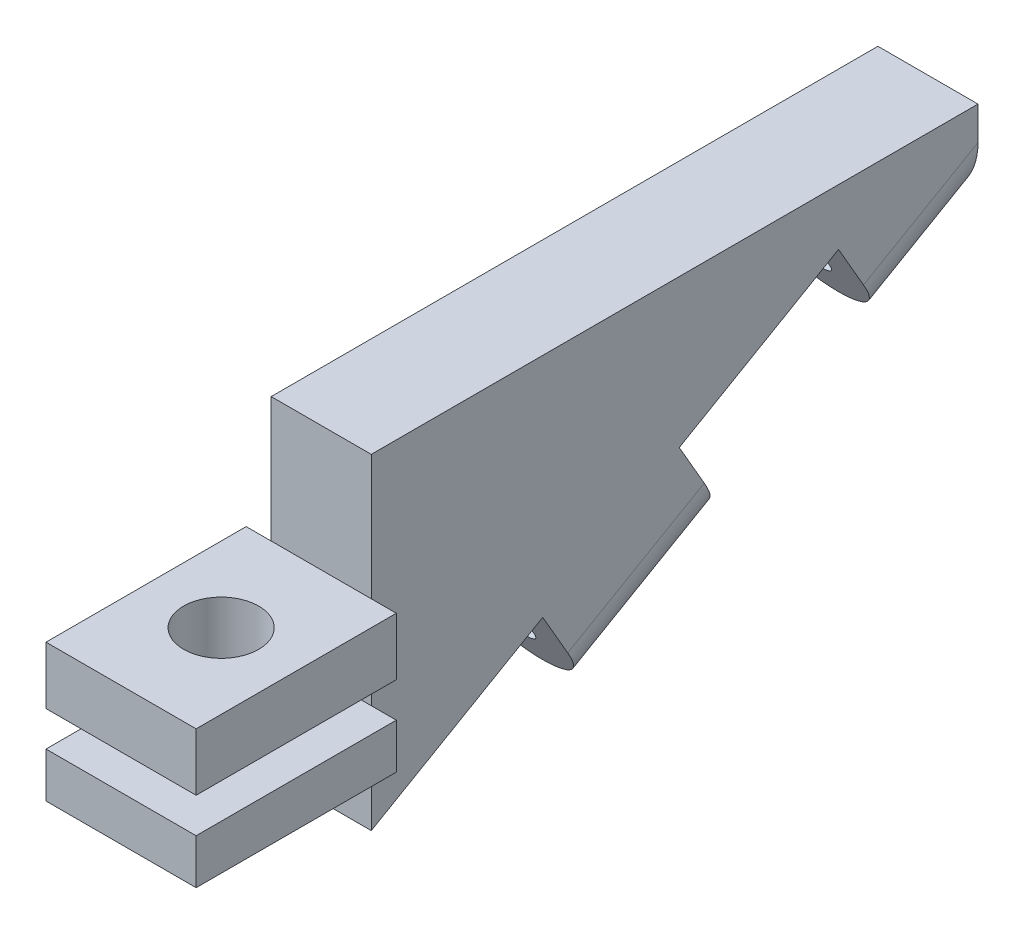
ISO-10303-21;
HEADER;
FILE_DESCRIPTION(('STEP AP214'),'2;1');
FILE_NAME('part.step','',(''),(''),'','','');
FILE_SCHEMA(('AUTOMOTIVE_DESIGN { 1 0 10303 214 1 1 1 1 }'));
ENDSEC;
DATA;
#1=APPLICATION_CONTEXT('core data for automotive mechanical design processes');
#2=APPLICATION_PROTOCOL_DEFINITION('international standard','automotive_design',2000,#1);
#3=PRODUCT_CONTEXT('',#1,'mechanical');
#4=PRODUCT('Part','Part','',(#3));
#5=PRODUCT_RELATED_PRODUCT_CATEGORY('part','',(#4));
#6=PRODUCT_DEFINITION_FORMATION('','',#4);
#7=PRODUCT_DEFINITION_CONTEXT('part definition',#1,'design');
#8=PRODUCT_DEFINITION('design','',#6,#7);
#9=PRODUCT_DEFINITION_SHAPE('','',#8);
#10=(LENGTH_UNIT() NAMED_UNIT(*) SI_UNIT(.MILLI.,.METRE.));
#11=(NAMED_UNIT(*) PLANE_ANGLE_UNIT() SI_UNIT($,.RADIAN.));
#12=(NAMED_UNIT(*) SI_UNIT($,.STERADIAN.) SOLID_ANGLE_UNIT());
#13=UNCERTAINTY_MEASURE_WITH_UNIT(LENGTH_MEASURE(1.E-05),#10,'distance_accuracy_value','');
#14=(GEOMETRIC_REPRESENTATION_CONTEXT(3) GLOBAL_UNCERTAINTY_ASSIGNED_CONTEXT((#13)) GLOBAL_UNIT_ASSIGNED_CONTEXT((#10,
#11,#12)) REPRESENTATION_CONTEXT('',''));
#15=CARTESIAN_POINT('',(0.,0.,0.));
#16=DIRECTION('',(0.,0.,1.));
#17=DIRECTION('',(1.,0.,0.));
#18=AXIS2_PLACEMENT_3D('',#15,#16,#17);
#19=CARTESIAN_POINT('',(3.,-1.,35.2487113059643));
#20=DIRECTION('',(0.,0.,-1.));
#21=DIRECTION('',(-1.,0.,0.));
#22=AXIS2_PLACEMENT_3D('',#19,#20,#21);
#23=PLANE('',#22);
#24=DIRECTION('',(0.,1.,0.));
#25=VECTOR('',#24,1.);
#26=CARTESIAN_POINT('',(-3.,-1.,35.2487113059643));
#27=LINE('',#26,#25);
#28=CARTESIAN_POINT('',(-3.,-1.,35.2487113059643));
#29=VERTEX_POINT('',#28);
#30=CARTESIAN_POINT('',(-3.,0.8,35.2487113059643));
#31=VERTEX_POINT('',#30);
#32=EDGE_CURVE('E312',#29,#31,#27,.T.);
#33=ORIENTED_EDGE('',*,*,#32,.T.);
#34=DIRECTION('',(-1.,0.,0.));
#35=VECTOR('',#34,1.);
#36=CARTESIAN_POINT('',(-3.,0.8,35.2487113059643));
#37=LINE('',#36,#35);
#38=CARTESIAN_POINT('',(-2.,0.8,35.2487113059643));
#39=VERTEX_POINT('',#38);
#40=EDGE_CURVE('E251',#39,#31,#37,.T.);
#41=ORIENTED_EDGE('',*,*,#40,.F.);
#42=DIRECTION('',(0.,1.,0.));
#43=VECTOR('',#42,1.);
#44=CARTESIAN_POINT('',(-2.,9.5,35.2487113059643));
#45=LINE('',#44,#43);
#46=CARTESIAN_POINT('',(-2.,-0.999999999999999,35.2487113059643));
#47=VERTEX_POINT('',#46);
#48=EDGE_CURVE('E339',#47,#39,#45,.T.);
#49=ORIENTED_EDGE('',*,*,#48,.F.);
#50=DIRECTION('',(-1.,0.,0.));
#51=VECTOR('',#50,1.);
#52=CARTESIAN_POINT('',(3.,-1.,35.2487113059643));
#53=LINE('',#52,#51);
#54=EDGE_CURVE('E306',#47,#29,#53,.T.);
#55=ORIENTED_EDGE('',*,*,#54,.T.);
#56=EDGE_LOOP('',(#33,#41,#49,#55));
#57=FACE_BOUND('',#56,.T.);
#58=ADVANCED_FACE('F35',(#57),#23,.T.);
#59=DIRECTION('',(0.,-1.,0.));
#60=VECTOR('',#59,1.);
#61=CARTESIAN_POINT('',(2.,9.5,35.2487113059643));
#62=LINE('',#61,#60);
#63=CARTESIAN_POINT('',(2.,0.8,35.2487113059643));
#64=VERTEX_POINT('',#63);
#65=CARTESIAN_POINT('',(2.,-1.,35.2487113059643));
#66=VERTEX_POINT('',#65);
#67=EDGE_CURVE('E347',#64,#66,#62,.T.);
#68=ORIENTED_EDGE('',*,*,#67,.F.);
#69=CARTESIAN_POINT('',(3.,0.8,35.2487113059643));
#70=VERTEX_POINT('',#69);
#71=EDGE_CURVE('E252',#70,#64,#37,.T.);
#72=ORIENTED_EDGE('',*,*,#71,.F.);
#73=DIRECTION('',(0.,1.,0.));
#74=VECTOR('',#73,1.);
#75=CARTESIAN_POINT('',(3.,-1.,35.2487113059643));
#76=LINE('',#75,#74);
#77=CARTESIAN_POINT('',(3.,-1.,35.2487113059643));
#78=VERTEX_POINT('',#77);
#79=EDGE_CURVE('E317',#78,#70,#76,.T.);
#80=ORIENTED_EDGE('',*,*,#79,.F.);
#81=EDGE_CURVE('E307',#78,#66,#53,.T.);
#82=ORIENTED_EDGE('',*,*,#81,.T.);
#83=EDGE_LOOP('',(#68,#72,#80,#82));
#84=FACE_BOUND('',#83,.T.);
#85=ADVANCED_FACE('F444',(#84),#23,.T.);
#86=CARTESIAN_POINT('',(-3.,-1.,43.2487113059643));
#87=DIRECTION('',(-1.,0.,0.));
#88=DIRECTION('',(0.,0.,1.));
#89=AXIS2_PLACEMENT_3D('',#86,#87,#88);
#90=PLANE('',#89);
#91=DIRECTION('',(0.,1.,0.));
#92=VECTOR('',#91,1.);
#93=CARTESIAN_POINT('',(-3.,-1.,43.2487113059643));
#94=LINE('',#93,#92);
#95=CARTESIAN_POINT('',(-3.,-1.,43.2487113059643));
#96=VERTEX_POINT('',#95);
#97=CARTESIAN_POINT('',(-3.,0.8,43.2487113059643));
#98=VERTEX_POINT('',#97);
#99=EDGE_CURVE('E325',#96,#98,#94,.T.);
#100=ORIENTED_EDGE('',*,*,#99,.T.);
#101=DIRECTION('',(0.,0.,1.));
#102=VECTOR('',#101,1.);
#103=CARTESIAN_POINT('',(-3.,0.8,35.2487113059643));
#104=LINE('',#103,#102);
#105=EDGE_CURVE('E219',#31,#98,#104,.T.);
#106=ORIENTED_EDGE('',*,*,#105,.F.);
#107=ORIENTED_EDGE('',*,*,#32,.F.);
#108=DIRECTION('',(0.,0.,1.));
#109=VECTOR('',#108,1.);
#110=CARTESIAN_POINT('',(-3.,-1.,43.2487113059643));
#111=LINE('',#110,#109);
#112=EDGE_CURVE('E296',#29,#96,#111,.T.);
#113=ORIENTED_EDGE('',*,*,#112,.T.);
#114=EDGE_LOOP('',(#100,#106,#107,#113));
#115=FACE_BOUND('',#114,.T.);
#116=ADVANCED_FACE('F428',(#115),#90,.T.);
#117=CARTESIAN_POINT('',(3.,-1.,43.2487113059643));
#118=DIRECTION('',(1.,0.,0.));
#119=DIRECTION('',(0.,0.,-1.));
#120=AXIS2_PLACEMENT_3D('',#117,#118,#119);
#121=PLANE('',#120);
#122=ORIENTED_EDGE('',*,*,#79,.T.);
#123=DIRECTION('',(0.,0.,-1.));
#124=VECTOR('',#123,1.);
#125=CARTESIAN_POINT('',(3.,0.8,43.2487113059643));
#126=LINE('',#125,#124);
#127=CARTESIAN_POINT('',(3.,0.8,43.2487113059643));
#128=VERTEX_POINT('',#127);
#129=EDGE_CURVE('E249',#128,#70,#126,.T.);
#130=ORIENTED_EDGE('',*,*,#129,.F.);
#131=DIRECTION('',(0.,1.,0.));
#132=VECTOR('',#131,1.);
#133=CARTESIAN_POINT('',(3.,-1.,43.2487113059643));
#134=LINE('',#133,#132);
#135=CARTESIAN_POINT('',(3.,-1.,43.2487113059643));
#136=VERTEX_POINT('',#135);
#137=EDGE_CURVE('E321',#136,#128,#134,.T.);
#138=ORIENTED_EDGE('',*,*,#137,.F.);
#139=DIRECTION('',(0.,0.,-1.));
#140=VECTOR('',#139,1.);
#141=CARTESIAN_POINT('',(3.,-1.,43.2487113059643));
#142=LINE('',#141,#140);
#143=EDGE_CURVE('E303',#136,#78,#142,.T.);
#144=ORIENTED_EDGE('',*,*,#143,.T.);
#145=EDGE_LOOP('',(#122,#130,#138,#144));
#146=FACE_BOUND('',#145,.T.);
#147=ADVANCED_FACE('F441',(#146),#121,.T.);
#148=CARTESIAN_POINT('',(3.,-1.,43.2487113059643));
#149=DIRECTION('',(0.,0.,1.));
#150=DIRECTION('',(1.,0.,0.));
#151=AXIS2_PLACEMENT_3D('',#148,#149,#150);
#152=PLANE('',#151);
#153=ORIENTED_EDGE('',*,*,#137,.T.);
#154=DIRECTION('',(1.,0.,0.));
#155=VECTOR('',#154,1.);
#156=CARTESIAN_POINT('',(-3.,0.8,43.2487113059643));
#157=LINE('',#156,#155);
#158=EDGE_CURVE('E247',#98,#128,#157,.T.);
#159=ORIENTED_EDGE('',*,*,#158,.F.);
#160=ORIENTED_EDGE('',*,*,#99,.F.);
#161=DIRECTION('',(1.,0.,0.));
#162=VECTOR('',#161,1.);
#163=CARTESIAN_POINT('',(3.,-1.,43.2487113059643));
#164=LINE('',#163,#162);
#165=EDGE_CURVE('E300',#96,#136,#164,.T.);
#166=ORIENTED_EDGE('',*,*,#165,.T.);
#167=EDGE_LOOP('',(#153,#159,#160,#166));
#168=FACE_BOUND('',#167,.T.);
#169=ADVANCED_FACE('F433',(#168),#152,.T.);
#170=CARTESIAN_POINT('',(0.,-6.5,39.2487113059643));
#171=DIRECTION('',(0.,1.,0.));
#172=DIRECTION('',(0.,0.,1.));
#173=AXIS2_PLACEMENT_3D('',#170,#171,#172);
#174=CYLINDRICAL_SURFACE('',#173,1.5);
#175=CARTESIAN_POINT('',(0.,-1.,39.2487113059643));
#176=DIRECTION('',(0.,1.,0.));
#177=DIRECTION('',(0.,0.,1.));
#178=AXIS2_PLACEMENT_3D('',#175,#176,#177);
#179=CIRCLE('',#178,1.5);
#180=CARTESIAN_POINT('',(0.,-1.,40.7487113059643));
#181=VERTEX_POINT('',#180);
#182=EDGE_CURVE('E280',#181,#181,#179,.T.);
#183=ORIENTED_EDGE('',*,*,#182,.F.);
#184=EDGE_LOOP('',(#183));
#185=FACE_BOUND('',#184,.T.);
#186=CARTESIAN_POINT('',(0.,0.8,39.2487113059643));
#187=DIRECTION('',(0.,1.,0.));
#188=DIRECTION('',(0.,0.,1.));
#189=AXIS2_PLACEMENT_3D('',#186,#187,#188);
#190=CIRCLE('',#189,1.5);
#191=CARTESIAN_POINT('',(0.,0.8,40.7487113059643));
#192=VERTEX_POINT('',#191);
#193=EDGE_CURVE('E269',#192,#192,#190,.F.);
#194=ORIENTED_EDGE('',*,*,#193,.F.);
#195=EDGE_LOOP('',(#194));
#196=FACE_BOUND('',#195,.T.);
#197=ADVANCED_FACE('F512',(#185,#196),#174,.F.);
#198=CARTESIAN_POINT('',(31.0516780926679,9.5,35.2487113059643));
#199=DIRECTION('',(0.,0.,-1.));
#200=DIRECTION('',(-1.,0.,0.));
#201=AXIS2_PLACEMENT_3D('',#198,#199,#200);
#202=PLANE('',#201);
#203=DIRECTION('',(-1.,0.,0.));
#204=VECTOR('',#203,1.);
#205=CARTESIAN_POINT('',(3.,4.5,35.2487113059643));
#206=LINE('',#205,#204);
#207=CARTESIAN_POINT('',(2.,4.5,35.2487113059643));
#208=VERTEX_POINT('',#207);
#209=CARTESIAN_POINT('',(-2.,4.5,35.2487113059643));
#210=VERTEX_POINT('',#209);
#211=EDGE_CURVE('E297',#208,#210,#206,.T.);
#212=ORIENTED_EDGE('',*,*,#211,.F.);
#213=CARTESIAN_POINT('',(2.,9.5,35.2487113059643));
#214=VERTEX_POINT('',#213);
#215=EDGE_CURVE('E343',#214,#208,#62,.T.);
#216=ORIENTED_EDGE('',*,*,#215,.F.);
#217=DIRECTION('',(-1.,0.,0.));
#218=VECTOR('',#217,1.);
#219=CARTESIAN_POINT('',(31.0516780926679,9.5,35.2487113059643));
#220=LINE('',#219,#218);
#221=CARTESIAN_POINT('',(-2.,9.5,35.2487113059643));
#222=VERTEX_POINT('',#221);
#223=EDGE_CURVE('E338',#214,#222,#220,.T.);
#224=ORIENTED_EDGE('',*,*,#223,.T.);
#225=EDGE_CURVE('E335',#210,#222,#45,.T.);
#226=ORIENTED_EDGE('',*,*,#225,.F.);
#227=EDGE_LOOP('',(#212,#216,#224,#226));
#228=FACE_BOUND('',#227,.T.);
#229=ADVANCED_FACE('F456',(#228),#202,.F.);
#230=CARTESIAN_POINT('',(-2.,0.,0.));
#231=DIRECTION('',(1.,0.,0.));
#232=DIRECTION('',(0.,0.,-1.));
#233=AXIS2_PLACEMENT_3D('',#230,#231,#232);
#234=PLANE('',#233);
#235=DIRECTION('',(0.,-1.,0.));
#236=VECTOR('',#235,1.);
#237=CARTESIAN_POINT('',(-2.,9.5,11.));
#238=LINE('',#237,#236);
#239=CARTESIAN_POINT('',(-2.,9.5,11.));
#240=VERTEX_POINT('',#239);
#241=CARTESIAN_POINT('',(-2.,8.16666666666687,11.));
#242=VERTEX_POINT('',#241);
#243=EDGE_CURVE('E330',#240,#242,#238,.T.);
#244=ORIENTED_EDGE('',*,*,#243,.T.);
#245=DIRECTION('',(0.,-0.500000000000007,0.866025403784435));
#246=VECTOR('',#245,1.);
#247=CARTESIAN_POINT('',(-2.,10.8881397208146,6.28627039878665));
#248=LINE('',#247,#246);
#249=CARTESIAN_POINT('',(-2.,5.52500000000014,15.5755008833278));
#250=VERTEX_POINT('',#249);
#251=EDGE_CURVE('E205',#242,#250,#248,.T.);
#252=ORIENTED_EDGE('',*,*,#251,.T.);
#253=DIRECTION('',(0.,0.866025403784438,0.500000000000001));
#254=VECTOR('',#253,1.);
#255=CARTESIAN_POINT('',(-2.,-5.36313972081439,9.28923048454127));
#256=LINE('',#255,#254);
#257=CARTESIAN_POINT('',(-2.,7.25705080756901,16.5755008833278));
#258=VERTEX_POINT('',#257);
#259=EDGE_CURVE('E198',#250,#258,#256,.T.);
#260=ORIENTED_EDGE('',*,*,#259,.T.);
#261=DIRECTION('',(0.,-0.500000000000007,0.866025403784435));
#262=VECTOR('',#261,1.);
#263=CARTESIAN_POINT('',(-2.,12.6201905283834,7.28627039878666));
#264=LINE('',#263,#262);
#265=CARTESIAN_POINT('',(-2.,3.58205080756896,22.9407876011434));
#266=VERTEX_POINT('',#265);
#267=EDGE_CURVE('E203',#258,#266,#264,.T.);
#268=ORIENTED_EDGE('',*,*,#267,.T.);
#269=DIRECTION('',(0.,-0.866025403784442,-0.499999999999995));
#270=VECTOR('',#269,1.);
#271=CARTESIAN_POINT('',(-2.,-9.03813972081434,15.654517202357));
#272=LINE('',#271,#270);
#273=CARTESIAN_POINT('',(-2.,1.8500000000001,21.9407876011434));
#274=VERTEX_POINT('',#273);
#275=EDGE_CURVE('E235',#266,#274,#272,.T.);
#276=ORIENTED_EDGE('',*,*,#275,.T.);
#277=DIRECTION('',(0.,-0.500000000000006,0.866025403784435));
#278=VECTOR('',#277,1.);
#279=CARTESIAN_POINT('',(-2.,10.8881397208146,6.28627039878665));
#280=LINE('',#279,#278);
#281=CARTESIAN_POINT('',(-2.,-1.29999999999997,27.3967476449854));
#282=VERTEX_POINT('',#281);
#283=EDGE_CURVE('E371',#274,#282,#280,.T.);
#284=ORIENTED_EDGE('',*,*,#283,.T.);
#285=DIRECTION('',(0.,0.866025403784436,0.500000000000005));
#286=VECTOR('',#285,1.);
#287=CARTESIAN_POINT('',(-2.,-12.1881397208145,21.1104772461988));
#288=LINE('',#287,#286);
#289=CARTESIAN_POINT('',(-2.,0.432050807568894,28.3967476449854));
#290=VERTEX_POINT('',#289);
#291=EDGE_CURVE('E240',#282,#290,#288,.T.);
#292=ORIENTED_EDGE('',*,*,#291,.T.);
#293=DIRECTION('',(0.,-0.500000000000006,0.866025403784435));
#294=VECTOR('',#293,1.);
#295=CARTESIAN_POINT('',(-2.,12.6201905283834,7.28627039878665));
#296=LINE('',#295,#294);
#297=CARTESIAN_POINT('',(-2.,-3.52393225657485,35.2487113059643));
#298=VERTEX_POINT('',#297);
#299=EDGE_CURVE('E220',#290,#298,#296,.T.);
#300=ORIENTED_EDGE('',*,*,#299,.T.);
#301=EDGE_CURVE('E336',#298,#47,#45,.T.);
#302=ORIENTED_EDGE('',*,*,#301,.T.);
#303=ORIENTED_EDGE('',*,*,#48,.T.);
#304=DIRECTION('',(0.,-1.,0.));
#305=VECTOR('',#304,1.);
#306=CARTESIAN_POINT('',(-2.,0.,35.2487113059643));
#307=LINE('',#306,#305);
#308=CARTESIAN_POINT('',(-2.,2.2,35.2487113059643));
#309=VERTEX_POINT('',#308);
#310=EDGE_CURVE('E274',#309,#39,#307,.T.);
#311=ORIENTED_EDGE('',*,*,#310,.F.);
#312=EDGE_CURVE('E340',#309,#210,#45,.T.);
#313=ORIENTED_EDGE('',*,*,#312,.T.);
#314=ORIENTED_EDGE('',*,*,#225,.T.);
#315=DIRECTION('',(0.,0.,-1.));
#316=VECTOR('',#315,1.);
#317=CARTESIAN_POINT('',(-2.,9.5,35.2487113059643));
#318=LINE('',#317,#316);
#319=EDGE_CURVE('E332',#222,#240,#318,.T.);
#320=ORIENTED_EDGE('',*,*,#319,.T.);
#321=EDGE_LOOP('',(#244,#252,#260,#268,#276,#284,#292,#300,#302,#303,#311,#313,#314,#320));
#322=FACE_BOUND('',#321,.T.);
#323=ADVANCED_FACE('F201',(#322),#234,.F.);
#324=CARTESIAN_POINT('',(2.,0.,0.));
#325=DIRECTION('',(1.,0.,0.));
#326=DIRECTION('',(0.,0.,-1.));
#327=AXIS2_PLACEMENT_3D('',#324,#325,#326);
#328=PLANE('',#327);
#329=DIRECTION('',(0.,0.866025403784438,0.500000000000001));
#330=VECTOR('',#329,1.);
#331=CARTESIAN_POINT('',(2.,-5.36313972081439,9.28923048454127));
#332=LINE('',#331,#330);
#333=CARTESIAN_POINT('',(2.,5.52500000000014,15.5755008833278));
#334=VERTEX_POINT('',#333);
#335=CARTESIAN_POINT('',(2.,7.25705080756901,16.5755008833278));
#336=VERTEX_POINT('',#335);
#337=EDGE_CURVE('E209',#334,#336,#332,.T.);
#338=ORIENTED_EDGE('',*,*,#337,.F.);
#339=DIRECTION('',(0.,-0.500000000000007,0.866025403784435));
#340=VECTOR('',#339,1.);
#341=CARTESIAN_POINT('',(2.,7.58931639747722,12.));
#342=LINE('',#341,#340);
#343=CARTESIAN_POINT('',(2.,8.16666666666687,11.));
#344=VERTEX_POINT('',#343);
#345=EDGE_CURVE('E385',#334,#344,#342,.F.);
#346=ORIENTED_EDGE('',*,*,#345,.T.);
#347=DIRECTION('',(0.,1.,0.));
#348=VECTOR('',#347,1.);
#349=CARTESIAN_POINT('',(2.,9.5,11.));
#350=LINE('',#349,#348);
#351=CARTESIAN_POINT('',(2.,9.5,11.));
#352=VERTEX_POINT('',#351);
#353=EDGE_CURVE('E341',#344,#352,#350,.T.);
#354=ORIENTED_EDGE('',*,*,#353,.T.);
#355=DIRECTION('',(0.,0.,1.));
#356=VECTOR('',#355,1.);
#357=CARTESIAN_POINT('',(2.,9.5,35.2487113059643));
#358=LINE('',#357,#356);
#359=EDGE_CURVE('E348',#352,#214,#358,.T.);
#360=ORIENTED_EDGE('',*,*,#359,.T.);
#361=ORIENTED_EDGE('',*,*,#215,.T.);
#362=CARTESIAN_POINT('',(2.,2.2,35.2487113059643));
#363=VERTEX_POINT('',#362);
#364=EDGE_CURVE('E346',#208,#363,#62,.T.);
#365=ORIENTED_EDGE('',*,*,#364,.T.);
#366=DIRECTION('',(0.,-1.,0.));
#367=VECTOR('',#366,1.);
#368=CARTESIAN_POINT('',(2.,0.,35.2487113059643));
#369=LINE('',#368,#367);
#370=EDGE_CURVE('E271',#363,#64,#369,.T.);
#371=ORIENTED_EDGE('',*,*,#370,.T.);
#372=ORIENTED_EDGE('',*,*,#67,.T.);
#373=CARTESIAN_POINT('',(2.,-3.52393225657485,35.2487113059643));
#374=VERTEX_POINT('',#373);
#375=EDGE_CURVE('E351',#66,#374,#62,.T.);
#376=ORIENTED_EDGE('',*,*,#375,.T.);
#377=DIRECTION('',(0.,-0.500000000000006,0.866025403784435));
#378=VECTOR('',#377,1.);
#379=CARTESIAN_POINT('',(2.,12.6201905283834,7.28627039878665));
#380=LINE('',#379,#378);
#381=CARTESIAN_POINT('',(2.,0.432050807568894,28.3967476449854));
#382=VERTEX_POINT('',#381);
#383=EDGE_CURVE('E242',#382,#374,#380,.T.);
#384=ORIENTED_EDGE('',*,*,#383,.F.);
#385=DIRECTION('',(0.,0.866025403784436,0.500000000000005));
#386=VECTOR('',#385,1.);
#387=CARTESIAN_POINT('',(2.,-12.1881397208145,21.1104772461988));
#388=LINE('',#387,#386);
#389=CARTESIAN_POINT('',(2.,-1.29999999999997,27.3967476449854));
#390=VERTEX_POINT('',#389);
#391=EDGE_CURVE('E238',#390,#382,#388,.T.);
#392=ORIENTED_EDGE('',*,*,#391,.F.);
#393=DIRECTION('',(0.,-0.500000000000006,0.866025403784435));
#394=VECTOR('',#393,1.);
#395=CARTESIAN_POINT('',(2.,1.85000000000008,21.9407876011435));
#396=LINE('',#395,#394);
#397=CARTESIAN_POINT('',(2.,1.8500000000001,21.9407876011434));
#398=VERTEX_POINT('',#397);
#399=EDGE_CURVE('E383',#390,#398,#396,.F.);
#400=ORIENTED_EDGE('',*,*,#399,.T.);
#401=DIRECTION('',(0.,-0.866025403784442,-0.499999999999995));
#402=VECTOR('',#401,1.);
#403=CARTESIAN_POINT('',(2.,-9.03813972081434,15.654517202357));
#404=LINE('',#403,#402);
#405=CARTESIAN_POINT('',(2.,3.58205080756896,22.9407876011434));
#406=VERTEX_POINT('',#405);
#407=EDGE_CURVE('E233',#406,#398,#404,.T.);
#408=ORIENTED_EDGE('',*,*,#407,.F.);
#409=DIRECTION('',(0.,-0.500000000000007,0.866025403784435));
#410=VECTOR('',#409,1.);
#411=CARTESIAN_POINT('',(2.,12.6201905283834,7.28627039878666));
#412=LINE('',#411,#410);
#413=EDGE_CURVE('E369',#336,#406,#412,.T.);
#414=ORIENTED_EDGE('',*,*,#413,.F.);
#415=EDGE_LOOP('',(#338,#346,#354,#360,#361,#365,#371,#372,#376,#384,#392,#400,#408,#414));
#416=FACE_BOUND('',#415,.T.);
#417=ADVANCED_FACE('F399',(#416),#328,.T.);
#418=ORIENTED_EDGE('',*,*,#301,.F.);
#419=DIRECTION('',(1.,0.,0.));
#420=VECTOR('',#419,1.);
#421=CARTESIAN_POINT('',(31.0516780926679,-3.52393225657485,35.2487113059643));
#422=LINE('',#421,#420);
#423=EDGE_CURVE('E366',#298,#374,#422,.T.);
#424=ORIENTED_EDGE('',*,*,#423,.T.);
#425=ORIENTED_EDGE('',*,*,#375,.F.);
#426=EDGE_CURVE('E311',#66,#47,#53,.T.);
#427=ORIENTED_EDGE('',*,*,#426,.T.);
#428=EDGE_LOOP('',(#418,#424,#425,#427));
#429=FACE_BOUND('',#428,.T.);
#430=ADVANCED_FACE('F415',(#429),#202,.F.);
#431=CARTESIAN_POINT('',(31.0516780926679,9.5,11.));
#432=DIRECTION('',(0.,0.,1.));
#433=DIRECTION('',(1.,0.,0.));
#434=AXIS2_PLACEMENT_3D('',#431,#432,#433);
#435=PLANE('',#434);
#436=CARTESIAN_POINT('',(0.,8.16666666666669,11.));
#437=DIRECTION('',(0.,0.,1.));
#438=DIRECTION('',(0.,-1.,0.));
#439=AXIS2_PLACEMENT_3D('',#436,#437,#438);
#440=ELLIPSE('',#439,0.750555349946512,0.649999999999999);
#441=CARTESIAN_POINT('',(0.,7.41611131672018,11.));
#442=VERTEX_POINT('',#441);
#443=EDGE_CURVE('E315',#442,#442,#440,.T.);
#444=ORIENTED_EDGE('',*,*,#443,.T.);
#445=EDGE_LOOP('',(#444));
#446=FACE_BOUND('',#445,.T.);
#447=CARTESIAN_POINT('',(0.,8.16666666666687,11.));
#448=DIRECTION('',(0.,0.,1.));
#449=DIRECTION('',(0.,1.,0.));
#450=AXIS2_PLACEMENT_3D('',#447,#448,#449);
#451=ELLIPSE('',#450,2.30940107675851,2.);
#452=CARTESIAN_POINT('',(0.,5.85726558990835,11.));
#453=VERTEX_POINT('',#452);
#454=EDGE_CURVE('E379',#344,#453,#451,.F.);
#455=ORIENTED_EDGE('',*,*,#454,.T.);
#456=CARTESIAN_POINT('',(0.,8.16666666666687,11.));
#457=DIRECTION('',(0.,0.,1.));
#458=DIRECTION('',(0.,-1.,0.));
#459=AXIS2_PLACEMENT_3D('',#456,#457,#458);
#460=ELLIPSE('',#459,2.30940107675851,2.);
#461=EDGE_CURVE('E381',#453,#242,#460,.F.);
#462=ORIENTED_EDGE('',*,*,#461,.T.);
#463=ORIENTED_EDGE('',*,*,#243,.F.);
#464=DIRECTION('',(-1.,0.,0.));
#465=VECTOR('',#464,1.);
#466=CARTESIAN_POINT('',(31.0516780926679,9.5,11.));
#467=LINE('',#466,#465);
#468=EDGE_CURVE('E352',#352,#240,#467,.T.);
#469=ORIENTED_EDGE('',*,*,#468,.F.);
#470=ORIENTED_EDGE('',*,*,#353,.F.);
#471=EDGE_LOOP('',(#455,#462,#463,#469,#470));
#472=FACE_BOUND('',#471,.T.);
#473=ADVANCED_FACE('F463',(#446,#472),#435,.F.);
#474=CARTESIAN_POINT('',(31.0516780926679,9.5,35.2487113059643));
#475=DIRECTION('',(0.,-1.,0.));
#476=DIRECTION('',(0.,0.,-1.));
#477=AXIS2_PLACEMENT_3D('',#474,#475,#476);
#478=PLANE('',#477);
#479=ORIENTED_EDGE('',*,*,#359,.F.);
#480=ORIENTED_EDGE('',*,*,#468,.T.);
#481=ORIENTED_EDGE('',*,*,#319,.F.);
#482=ORIENTED_EDGE('',*,*,#223,.F.);
#483=EDGE_LOOP('',(#479,#480,#481,#482));
#484=FACE_BOUND('',#483,.T.);
#485=ADVANCED_FACE('F459',(#484),#478,.F.);
#486=CARTESIAN_POINT('',(0.,15.8612159321678,-2.32735026918959));
#487=DIRECTION('',(0.,-0.500000000000001,0.866025403784438));
#488=DIRECTION('',(0.,-0.866025403784438,-0.500000000000001));
#489=AXIS2_PLACEMENT_3D('',#486,#487,#488);
#490=CYLINDRICAL_SURFACE('',#489,0.649999999999999);
#491=CARTESIAN_POINT('',(0.,5.52500000000003,15.5755008833278));
#492=DIRECTION('',(0.,0.500000000000001,-0.866025403784438));
#493=DIRECTION('',(0.,0.866025403784438,0.500000000000001));
#494=AXIS2_PLACEMENT_3D('',#491,#492,#493);
#495=CIRCLE('',#494,0.649999999999999);
#496=CARTESIAN_POINT('',(0.,6.08791651245991,15.9005008833278));
#497=VERTEX_POINT('',#496);
#498=EDGE_CURVE('E231',#497,#497,#495,.F.);
#499=ORIENTED_EDGE('',*,*,#498,.T.);
#500=EDGE_LOOP('',(#499));
#501=FACE_BOUND('',#500,.T.);
#502=ORIENTED_EDGE('',*,*,#443,.F.);
#503=EDGE_LOOP('',(#502));
#504=FACE_BOUND('',#503,.T.);
#505=ADVANCED_FACE('F521',(#501,#504),#490,.F.);
#506=DIRECTION('',(-1.,0.,0.));
#507=VECTOR('',#506,1.);
#508=CARTESIAN_POINT('',(-3.,2.2,35.2487113059643));
#509=LINE('',#508,#507);
#510=CARTESIAN_POINT('',(-3.,2.2,35.2487113059643));
#511=VERTEX_POINT('',#510);
#512=EDGE_CURVE('E265',#309,#511,#509,.T.);
#513=ORIENTED_EDGE('',*,*,#512,.T.);
#514=CARTESIAN_POINT('',(-3.,4.5,35.2487113059643));
#515=VERTEX_POINT('',#514);
#516=EDGE_CURVE('E316',#511,#515,#27,.T.);
#517=ORIENTED_EDGE('',*,*,#516,.T.);
#518=EDGE_CURVE('E292',#210,#515,#206,.T.);
#519=ORIENTED_EDGE('',*,*,#518,.F.);
#520=ORIENTED_EDGE('',*,*,#312,.F.);
#521=EDGE_LOOP('',(#513,#517,#519,#520));
#522=FACE_BOUND('',#521,.T.);
#523=ADVANCED_FACE('F500',(#522),#23,.T.);
#524=CARTESIAN_POINT('',(3.,2.2,35.2487113059643));
#525=VERTEX_POINT('',#524);
#526=EDGE_CURVE('E266',#525,#363,#509,.T.);
#527=ORIENTED_EDGE('',*,*,#526,.T.);
#528=ORIENTED_EDGE('',*,*,#364,.F.);
#529=CARTESIAN_POINT('',(3.,4.5,35.2487113059643));
#530=VERTEX_POINT('',#529);
#531=EDGE_CURVE('E293',#530,#208,#206,.T.);
#532=ORIENTED_EDGE('',*,*,#531,.F.);
#533=EDGE_CURVE('E320',#525,#530,#76,.T.);
#534=ORIENTED_EDGE('',*,*,#533,.F.);
#535=EDGE_LOOP('',(#527,#528,#532,#534));
#536=FACE_BOUND('',#535,.T.);
#537=ADVANCED_FACE('F476',(#536),#23,.T.);
#538=DIRECTION('',(0.,0.,1.));
#539=VECTOR('',#538,1.);
#540=CARTESIAN_POINT('',(-3.,2.2,35.2487113059643));
#541=LINE('',#540,#539);
#542=CARTESIAN_POINT('',(-3.,2.2,43.2487113059643));
#543=VERTEX_POINT('',#542);
#544=EDGE_CURVE('E255',#511,#543,#541,.T.);
#545=ORIENTED_EDGE('',*,*,#544,.T.);
#546=CARTESIAN_POINT('',(-3.,4.5,43.2487113059643));
#547=VERTEX_POINT('',#546);
#548=EDGE_CURVE('E310',#543,#547,#94,.T.);
#549=ORIENTED_EDGE('',*,*,#548,.T.);
#550=DIRECTION('',(0.,0.,1.));
#551=VECTOR('',#550,1.);
#552=CARTESIAN_POINT('',(-3.,4.5,43.2487113059643));
#553=LINE('',#552,#551);
#554=EDGE_CURVE('E283',#515,#547,#553,.T.);
#555=ORIENTED_EDGE('',*,*,#554,.F.);
#556=ORIENTED_EDGE('',*,*,#516,.F.);
#557=EDGE_LOOP('',(#545,#549,#555,#556));
#558=FACE_BOUND('',#557,.T.);
#559=ADVANCED_FACE('F495',(#558),#90,.T.);
#560=DIRECTION('',(0.,0.,-1.));
#561=VECTOR('',#560,1.);
#562=CARTESIAN_POINT('',(3.,2.2,43.2487113059643));
#563=LINE('',#562,#561);
#564=CARTESIAN_POINT('',(3.,2.2,43.2487113059643));
#565=VERTEX_POINT('',#564);
#566=EDGE_CURVE('E262',#565,#525,#563,.T.);
#567=ORIENTED_EDGE('',*,*,#566,.T.);
#568=ORIENTED_EDGE('',*,*,#533,.T.);
#569=DIRECTION('',(0.,0.,-1.));
#570=VECTOR('',#569,1.);
#571=CARTESIAN_POINT('',(3.,4.5,43.2487113059643));
#572=LINE('',#571,#570);
#573=CARTESIAN_POINT('',(3.,4.5,43.2487113059643));
#574=VERTEX_POINT('',#573);
#575=EDGE_CURVE('E289',#574,#530,#572,.T.);
#576=ORIENTED_EDGE('',*,*,#575,.F.);
#577=EDGE_CURVE('E324',#565,#574,#134,.T.);
#578=ORIENTED_EDGE('',*,*,#577,.F.);
#579=EDGE_LOOP('',(#567,#568,#576,#578));
#580=FACE_BOUND('',#579,.T.);
#581=ADVANCED_FACE('F485',(#580),#121,.T.);
#582=DIRECTION('',(1.,0.,0.));
#583=VECTOR('',#582,1.);
#584=CARTESIAN_POINT('',(-3.,2.2,43.2487113059643));
#585=LINE('',#584,#583);
#586=EDGE_CURVE('E259',#543,#565,#585,.T.);
#587=ORIENTED_EDGE('',*,*,#586,.T.);
#588=ORIENTED_EDGE('',*,*,#577,.T.);
#589=DIRECTION('',(1.,0.,0.));
#590=VECTOR('',#589,1.);
#591=CARTESIAN_POINT('',(3.,4.5,43.2487113059643));
#592=LINE('',#591,#590);
#593=EDGE_CURVE('E286',#547,#574,#592,.T.);
#594=ORIENTED_EDGE('',*,*,#593,.F.);
#595=ORIENTED_EDGE('',*,*,#548,.F.);
#596=EDGE_LOOP('',(#587,#588,#594,#595));
#597=FACE_BOUND('',#596,.T.);
#598=ADVANCED_FACE('F492',(#597),#152,.T.);
#599=CARTESIAN_POINT('',(0.,-1.,0.));
#600=DIRECTION('',(0.,1.,0.));
#601=DIRECTION('',(0.,0.,1.));
#602=AXIS2_PLACEMENT_3D('',#599,#600,#601);
#603=PLANE('',#602);
#604=ORIENTED_EDGE('',*,*,#182,.T.);
#605=EDGE_LOOP('',(#604));
#606=FACE_BOUND('',#605,.T.);
#607=ORIENTED_EDGE('',*,*,#112,.F.);
#608=ORIENTED_EDGE('',*,*,#54,.F.);
#609=ORIENTED_EDGE('',*,*,#426,.F.);
#610=ORIENTED_EDGE('',*,*,#81,.F.);
#611=ORIENTED_EDGE('',*,*,#143,.F.);
#612=ORIENTED_EDGE('',*,*,#165,.F.);
#613=EDGE_LOOP('',(#607,#608,#609,#610,#611,#612));
#614=FACE_BOUND('',#613,.T.);
#615=ADVANCED_FACE('F430',(#606,#614),#603,.F.);
#616=CARTESIAN_POINT('',(0.,4.5,0.));
#617=DIRECTION('',(0.,1.,0.));
#618=DIRECTION('',(0.,0.,1.));
#619=AXIS2_PLACEMENT_3D('',#616,#617,#618);
#620=PLANE('',#619);
#621=CARTESIAN_POINT('',(0.,4.5,39.2487113059643));
#622=DIRECTION('',(0.,1.,0.));
#623=DIRECTION('',(0.,0.,1.));
#624=AXIS2_PLACEMENT_3D('',#621,#622,#623);
#625=CIRCLE('',#624,1.5);
#626=CARTESIAN_POINT('',(0.,4.5,40.7487113059643));
#627=VERTEX_POINT('',#626);
#628=EDGE_CURVE('E277',#627,#627,#625,.T.);
#629=ORIENTED_EDGE('',*,*,#628,.F.);
#630=EDGE_LOOP('',(#629));
#631=FACE_BOUND('',#630,.T.);
#632=ORIENTED_EDGE('',*,*,#554,.T.);
#633=ORIENTED_EDGE('',*,*,#593,.T.);
#634=ORIENTED_EDGE('',*,*,#575,.T.);
#635=ORIENTED_EDGE('',*,*,#531,.T.);
#636=ORIENTED_EDGE('',*,*,#211,.T.);
#637=ORIENTED_EDGE('',*,*,#518,.T.);
#638=EDGE_LOOP('',(#632,#633,#634,#635,#636,#637));
#639=FACE_BOUND('',#638,.T.);
#640=ADVANCED_FACE('F479',(#631,#639),#620,.T.);
#641=CARTESIAN_POINT('',(0.,2.2,39.2487113059643));
#642=DIRECTION('',(0.,1.,0.));
#643=DIRECTION('',(0.,0.,1.));
#644=AXIS2_PLACEMENT_3D('',#641,#642,#643);
#645=CIRCLE('',#644,1.5);
#646=CARTESIAN_POINT('',(0.,2.2,40.7487113059643));
#647=VERTEX_POINT('',#646);
#648=EDGE_CURVE('E275',#647,#647,#645,.F.);
#649=ORIENTED_EDGE('',*,*,#648,.T.);
#650=EDGE_LOOP('',(#649));
#651=FACE_BOUND('',#650,.T.);
#652=ORIENTED_EDGE('',*,*,#628,.T.);
#653=EDGE_LOOP('',(#652));
#654=FACE_BOUND('',#653,.T.);
#655=ADVANCED_FACE('F503',(#651,#654),#174,.F.);
#656=CARTESIAN_POINT('',(-3.,2.2,35.2487113059643));
#657=DIRECTION('',(0.,0.,1.));
#658=DIRECTION('',(1.,0.,0.));
#659=AXIS2_PLACEMENT_3D('',#656,#657,#658);
#660=PLANE('',#659);
#661=ORIENTED_EDGE('',*,*,#310,.T.);
#662=EDGE_CURVE('E256',#64,#39,#37,.T.);
#663=ORIENTED_EDGE('',*,*,#662,.F.);
#664=ORIENTED_EDGE('',*,*,#370,.F.);
#665=EDGE_CURVE('E270',#363,#309,#509,.T.);
#666=ORIENTED_EDGE('',*,*,#665,.T.);
#667=EDGE_LOOP('',(#661,#663,#664,#666));
#668=FACE_BOUND('',#667,.T.);
#669=ADVANCED_FACE('F501',(#668),#660,.T.);
#670=CARTESIAN_POINT('',(0.,2.2,0.));
#671=DIRECTION('',(0.,1.,0.));
#672=DIRECTION('',(0.,0.,1.));
#673=AXIS2_PLACEMENT_3D('',#670,#671,#672);
#674=PLANE('',#673);
#675=ORIENTED_EDGE('',*,*,#544,.F.);
#676=ORIENTED_EDGE('',*,*,#512,.F.);
#677=ORIENTED_EDGE('',*,*,#665,.F.);
#678=ORIENTED_EDGE('',*,*,#526,.F.);
#679=ORIENTED_EDGE('',*,*,#566,.F.);
#680=ORIENTED_EDGE('',*,*,#586,.F.);
#681=EDGE_LOOP('',(#675,#676,#677,#678,#679,#680));
#682=FACE_BOUND('',#681,.T.);
#683=ORIENTED_EDGE('',*,*,#648,.F.);
#684=EDGE_LOOP('',(#683));
#685=FACE_BOUND('',#684,.T.);
#686=ADVANCED_FACE('F487',(#682,#685),#674,.F.);
#687=CARTESIAN_POINT('',(0.,0.8,0.));
#688=DIRECTION('',(0.,1.,0.));
#689=DIRECTION('',(0.,0.,1.));
#690=AXIS2_PLACEMENT_3D('',#687,#688,#689);
#691=PLANE('',#690);
#692=ORIENTED_EDGE('',*,*,#105,.T.);
#693=ORIENTED_EDGE('',*,*,#158,.T.);
#694=ORIENTED_EDGE('',*,*,#129,.T.);
#695=ORIENTED_EDGE('',*,*,#71,.T.);
#696=ORIENTED_EDGE('',*,*,#662,.T.);
#697=ORIENTED_EDGE('',*,*,#40,.T.);
#698=EDGE_LOOP('',(#692,#693,#694,#695,#696,#697));
#699=FACE_BOUND('',#698,.T.);
#700=ORIENTED_EDGE('',*,*,#193,.T.);
#701=EDGE_LOOP('',(#700));
#702=FACE_BOUND('',#701,.T.);
#703=ADVANCED_FACE('F437',(#699,#702),#691,.T.);
#704=CARTESIAN_POINT('',(-6.,7.25705080756901,16.5755008833278));
#705=DIRECTION('',(0.,0.866025403784435,0.500000000000007));
#706=DIRECTION('',(0.,-0.500000000000007,0.866025403784435));
#707=AXIS2_PLACEMENT_3D('',#704,#705,#706);
#708=PLANE('',#707);
#709=DIRECTION('',(1.,0.,0.));
#710=VECTOR('',#709,1.);
#711=CARTESIAN_POINT('',(-6.,7.25705080756901,16.5755008833278));
#712=LINE('',#711,#710);
#713=EDGE_CURVE('E215',#258,#336,#712,.T.);
#714=ORIENTED_EDGE('',*,*,#713,.T.);
#715=ORIENTED_EDGE('',*,*,#413,.T.);
#716=DIRECTION('',(1.,0.,0.));
#717=VECTOR('',#716,1.);
#718=CARTESIAN_POINT('',(-6.,3.58205080756896,22.9407876011434));
#719=LINE('',#718,#717);
#720=EDGE_CURVE('E218',#266,#406,#719,.T.);
#721=ORIENTED_EDGE('',*,*,#720,.F.);
#722=ORIENTED_EDGE('',*,*,#267,.F.);
#723=EDGE_LOOP('',(#714,#715,#721,#722));
#724=FACE_BOUND('',#723,.T.);
#725=ADVANCED_FACE('F214',(#724),#708,.F.);
#726=CARTESIAN_POINT('',(-6.,0.432050807568894,28.3967476449854));
#727=DIRECTION('',(0.,0.866025403784435,0.500000000000006));
#728=DIRECTION('',(0.,-0.500000000000006,0.866025403784435));
#729=AXIS2_PLACEMENT_3D('',#726,#727,#728);
#730=PLANE('',#729);
#731=DIRECTION('',(1.,0.,0.));
#732=VECTOR('',#731,1.);
#733=CARTESIAN_POINT('',(-6.,0.432050807568894,28.3967476449854));
#734=LINE('',#733,#732);
#735=EDGE_CURVE('E226',#290,#382,#734,.T.);
#736=ORIENTED_EDGE('',*,*,#735,.T.);
#737=ORIENTED_EDGE('',*,*,#383,.T.);
#738=ORIENTED_EDGE('',*,*,#423,.F.);
#739=ORIENTED_EDGE('',*,*,#299,.F.);
#740=EDGE_LOOP('',(#736,#737,#738,#739));
#741=FACE_BOUND('',#740,.T.);
#742=ADVANCED_FACE('F409',(#741),#730,.F.);
#743=CARTESIAN_POINT('',(-6.,-3.03205080756884,26.3967476449854));
#744=DIRECTION('',(0.,0.500000000000005,-0.866025403784436));
#745=DIRECTION('',(0.,0.866025403784436,0.500000000000005));
#746=AXIS2_PLACEMENT_3D('',#743,#744,#745);
#747=PLANE('',#746);
#748=CARTESIAN_POINT('',(0.,-1.30000000000001,27.3967476449854));
#749=DIRECTION('',(0.,0.500000000000005,-0.866025403784436));
#750=DIRECTION('',(0.,0.866025403784436,0.500000000000005));
#751=AXIS2_PLACEMENT_3D('',#748,#749,#750);
#752=CIRCLE('',#751,0.649999999999999);
#753=CARTESIAN_POINT('',(0.,-0.737083487540128,27.7217476449854));
#754=VERTEX_POINT('',#753);
#755=EDGE_CURVE('E237',#754,#754,#752,.F.);
#756=ORIENTED_EDGE('',*,*,#755,.F.);
#757=EDGE_LOOP('',(#756));
#758=FACE_BOUND('',#757,.T.);
#759=ORIENTED_EDGE('',*,*,#291,.F.);
#760=CARTESIAN_POINT('',(0.,-1.29999999999997,27.3967476449854));
#761=DIRECTION('',(0.,0.500000000000005,-0.866025403784436));
#762=DIRECTION('',(0.,0.866025403784436,0.500000000000005));
#763=AXIS2_PLACEMENT_3D('',#760,#761,#762);
#764=CIRCLE('',#763,2.);
#765=CARTESIAN_POINT('',(0.,-3.03205080756884,26.3967476449854));
#766=VERTEX_POINT('',#765);
#767=EDGE_CURVE('E58',#282,#766,#764,.F.);
#768=ORIENTED_EDGE('',*,*,#767,.T.);
#769=CARTESIAN_POINT('',(0.,-1.29999999999997,27.3967476449854));
#770=DIRECTION('',(0.,0.500000000000005,-0.866025403784436));
#771=DIRECTION('',(0.,0.866025403784436,0.500000000000005));
#772=AXIS2_PLACEMENT_3D('',#769,#770,#771);
#773=CIRCLE('',#772,2.);
#774=EDGE_CURVE('E387',#766,#390,#773,.F.);
#775=ORIENTED_EDGE('',*,*,#774,.T.);
#776=ORIENTED_EDGE('',*,*,#391,.T.);
#777=ORIENTED_EDGE('',*,*,#735,.F.);
#778=EDGE_LOOP('',(#759,#768,#775,#776,#777));
#779=FACE_BOUND('',#778,.T.);
#780=ADVANCED_FACE('F391',(#758,#779),#747,.F.);
#781=CARTESIAN_POINT('',(-6.,3.58205080756896,22.9407876011434));
#782=DIRECTION('',(0.,-0.499999999999995,0.866025403784441));
#783=DIRECTION('',(0.,-0.866025403784442,-0.499999999999995));
#784=AXIS2_PLACEMENT_3D('',#781,#782,#783);
#785=PLANE('',#784);
#786=CARTESIAN_POINT('',(0.,1.85000000000002,21.9407876011434));
#787=DIRECTION('',(0.,-0.499999999999995,0.866025403784441));
#788=DIRECTION('',(0.,-0.866025403784442,-0.499999999999995));
#789=AXIS2_PLACEMENT_3D('',#786,#787,#788);
#790=CIRCLE('',#789,0.649999999999999);
#791=CARTESIAN_POINT('',(0.,1.28708348754013,21.6157876011434));
#792=VERTEX_POINT('',#791);
#793=EDGE_CURVE('E208',#792,#792,#790,.F.);
#794=ORIENTED_EDGE('',*,*,#793,.F.);
#795=EDGE_LOOP('',(#794));
#796=FACE_BOUND('',#795,.T.);
#797=CARTESIAN_POINT('',(0.,1.85000000000009,21.9407876011434));
#798=DIRECTION('',(0.,-0.499999999999995,0.866025403784441));
#799=DIRECTION('',(0.,-0.866025403784442,-0.499999999999995));
#800=AXIS2_PLACEMENT_3D('',#797,#798,#799);
#801=CIRCLE('',#800,2.);
#802=CARTESIAN_POINT('',(0.,0.117949192431209,20.9407876011434));
#803=VERTEX_POINT('',#802);
#804=EDGE_CURVE('E44',#398,#803,#801,.F.);
#805=ORIENTED_EDGE('',*,*,#804,.T.);
#806=CARTESIAN_POINT('',(0.,1.85000000000009,21.9407876011434));
#807=DIRECTION('',(0.,-0.499999999999995,0.866025403784441));
#808=DIRECTION('',(0.,-0.866025403784442,-0.499999999999995));
#809=AXIS2_PLACEMENT_3D('',#806,#807,#808);
#810=CIRCLE('',#809,2.);
#811=EDGE_CURVE('E11',#803,#274,#810,.F.);
#812=ORIENTED_EDGE('',*,*,#811,.T.);
#813=ORIENTED_EDGE('',*,*,#275,.F.);
#814=ORIENTED_EDGE('',*,*,#720,.T.);
#815=ORIENTED_EDGE('',*,*,#407,.T.);
#816=EDGE_LOOP('',(#805,#812,#813,#814,#815));
#817=FACE_BOUND('',#816,.T.);
#818=ADVANCED_FACE('F406',(#796,#817),#785,.F.);
#819=CARTESIAN_POINT('',(-6.,3.79294919243126,14.5755008833278));
#820=DIRECTION('',(0.,0.500000000000001,-0.866025403784438));
#821=DIRECTION('',(0.,0.866025403784438,0.500000000000001));
#822=AXIS2_PLACEMENT_3D('',#819,#820,#821);
#823=PLANE('',#822);
#824=ORIENTED_EDGE('',*,*,#498,.F.);
#825=EDGE_LOOP('',(#824));
#826=FACE_BOUND('',#825,.T.);
#827=ORIENTED_EDGE('',*,*,#259,.F.);
#828=CARTESIAN_POINT('',(0.,5.52500000000014,15.5755008833278));
#829=DIRECTION('',(0.,0.500000000000001,-0.866025403784438));
#830=DIRECTION('',(0.,0.866025403784438,0.500000000000001));
#831=AXIS2_PLACEMENT_3D('',#828,#829,#830);
#832=CIRCLE('',#831,2.);
#833=CARTESIAN_POINT('',(0.,3.79294919243126,14.5755008833278));
#834=VERTEX_POINT('',#833);
#835=EDGE_CURVE('E377',#250,#834,#832,.F.);
#836=ORIENTED_EDGE('',*,*,#835,.T.);
#837=CARTESIAN_POINT('',(0.,5.52500000000014,15.5755008833278));
#838=DIRECTION('',(0.,0.500000000000001,-0.866025403784438));
#839=DIRECTION('',(0.,0.866025403784438,0.500000000000001));
#840=AXIS2_PLACEMENT_3D('',#837,#838,#839);
#841=CIRCLE('',#840,2.);
#842=EDGE_CURVE('E375',#834,#334,#841,.F.);
#843=ORIENTED_EDGE('',*,*,#842,.T.);
#844=ORIENTED_EDGE('',*,*,#337,.T.);
#845=ORIENTED_EDGE('',*,*,#713,.F.);
#846=EDGE_LOOP('',(#827,#836,#843,#844,#845));
#847=FACE_BOUND('',#846,.T.);
#848=ADVANCED_FACE('F222',(#826,#847),#823,.F.);
#849=ORIENTED_EDGE('',*,*,#755,.T.);
#850=EDGE_LOOP('',(#849));
#851=FACE_BOUND('',#850,.T.);
#852=ORIENTED_EDGE('',*,*,#793,.T.);
#853=EDGE_LOOP('',(#852));
#854=FACE_BOUND('',#853,.T.);
#855=ADVANCED_FACE('F528',(#851,#854),#490,.F.);
#856=CARTESIAN_POINT('',(0.,8.80346975910192,9.89702468948554));
#857=DIRECTION('',(0.,0.500000000000007,-0.866025403784435));
#858=DIRECTION('',(0.,0.866025403784435,0.500000000000007));
#859=AXIS2_PLACEMENT_3D('',#856,#857,#858);
#860=CYLINDRICAL_SURFACE('',#859,2.);
#861=DIRECTION('',(0.,-0.500000000000007,0.866025403784435));
#862=VECTOR('',#861,1.);
#863=CARTESIAN_POINT('',(0.,3.79294919243126,14.5755008833278));
#864=LINE('',#863,#862);
#865=EDGE_CURVE('E224',#453,#834,#864,.T.);
#866=ORIENTED_EDGE('',*,*,#865,.F.);
#867=ORIENTED_EDGE('',*,*,#454,.F.);
#868=ORIENTED_EDGE('',*,*,#345,.F.);
#869=ORIENTED_EDGE('',*,*,#842,.F.);
#870=EDGE_LOOP('',(#866,#867,#868,#869));
#871=FACE_BOUND('',#870,.T.);
#872=ADVANCED_FACE('F472',(#871),#860,.T.);
#873=CARTESIAN_POINT('',(0.,10.8881397208146,6.28627039878665));
#874=DIRECTION('',(0.,-0.500000000000007,0.866025403784435));
#875=DIRECTION('',(0.,-0.866025403784435,-0.500000000000007));
#876=AXIS2_PLACEMENT_3D('',#873,#874,#875);
#877=CYLINDRICAL_SURFACE('',#876,2.);
#878=ORIENTED_EDGE('',*,*,#461,.F.);
#879=ORIENTED_EDGE('',*,*,#865,.T.);
#880=ORIENTED_EDGE('',*,*,#835,.F.);
#881=ORIENTED_EDGE('',*,*,#251,.F.);
#882=EDGE_LOOP('',(#878,#879,#880,#881));
#883=FACE_BOUND('',#882,.T.);
#884=ADVANCED_FACE('F467',(#883),#877,.T.);
#885=CARTESIAN_POINT('',(0.,1.85000000000008,21.9407876011435));
#886=DIRECTION('',(0.,0.500000000000006,-0.866025403784435));
#887=DIRECTION('',(0.,0.866025403784435,0.500000000000007));
#888=AXIS2_PLACEMENT_3D('',#885,#886,#887);
#889=CYLINDRICAL_SURFACE('',#888,2.);
#890=DIRECTION('',(0.,-0.500000000000006,0.866025403784435));
#891=VECTOR('',#890,1.);
#892=CARTESIAN_POINT('',(0.,-3.03205080756884,26.3967476449854));
#893=LINE('',#892,#891);
#894=EDGE_CURVE('E39',#803,#766,#893,.T.);
#895=ORIENTED_EDGE('',*,*,#894,.F.);
#896=ORIENTED_EDGE('',*,*,#804,.F.);
#897=ORIENTED_EDGE('',*,*,#399,.F.);
#898=ORIENTED_EDGE('',*,*,#774,.F.);
#899=EDGE_LOOP('',(#895,#896,#897,#898));
#900=FACE_BOUND('',#899,.T.);
#901=ADVANCED_FACE('F37',(#900),#889,.T.);
#902=CARTESIAN_POINT('',(0.,10.8881397208146,6.28627039878665));
#903=DIRECTION('',(0.,-0.500000000000006,0.866025403784435));
#904=DIRECTION('',(0.,-0.866025403784435,-0.500000000000007));
#905=AXIS2_PLACEMENT_3D('',#902,#903,#904);
#906=CYLINDRICAL_SURFACE('',#905,2.);
#907=ORIENTED_EDGE('',*,*,#811,.F.);
#908=ORIENTED_EDGE('',*,*,#894,.T.);
#909=ORIENTED_EDGE('',*,*,#767,.F.);
#910=ORIENTED_EDGE('',*,*,#283,.F.);
#911=EDGE_LOOP('',(#907,#908,#909,#910));
#912=FACE_BOUND('',#911,.T.);
#913=ADVANCED_FACE('F405',(#912),#906,.T.);
#914=CLOSED_SHELL('',(#58,#85,#116,#147,#169,#197,#229,#323,#417,#430,#473,#485,#505,#523,#537,
#559,#581,#598,#615,#640,#655,#669,#686,#703,#725,#742,#780,#818,#848,#855,#872,#884,#901,#913));
#915=MANIFOLD_SOLID_BREP('B2',#914);
#916=ADVANCED_BREP_SHAPE_REPRESENTATION('',(#18,#915),#14);
#917=SHAPE_DEFINITION_REPRESENTATION(#9,#916);
ENDSEC;
END-ISO-10303-21;
